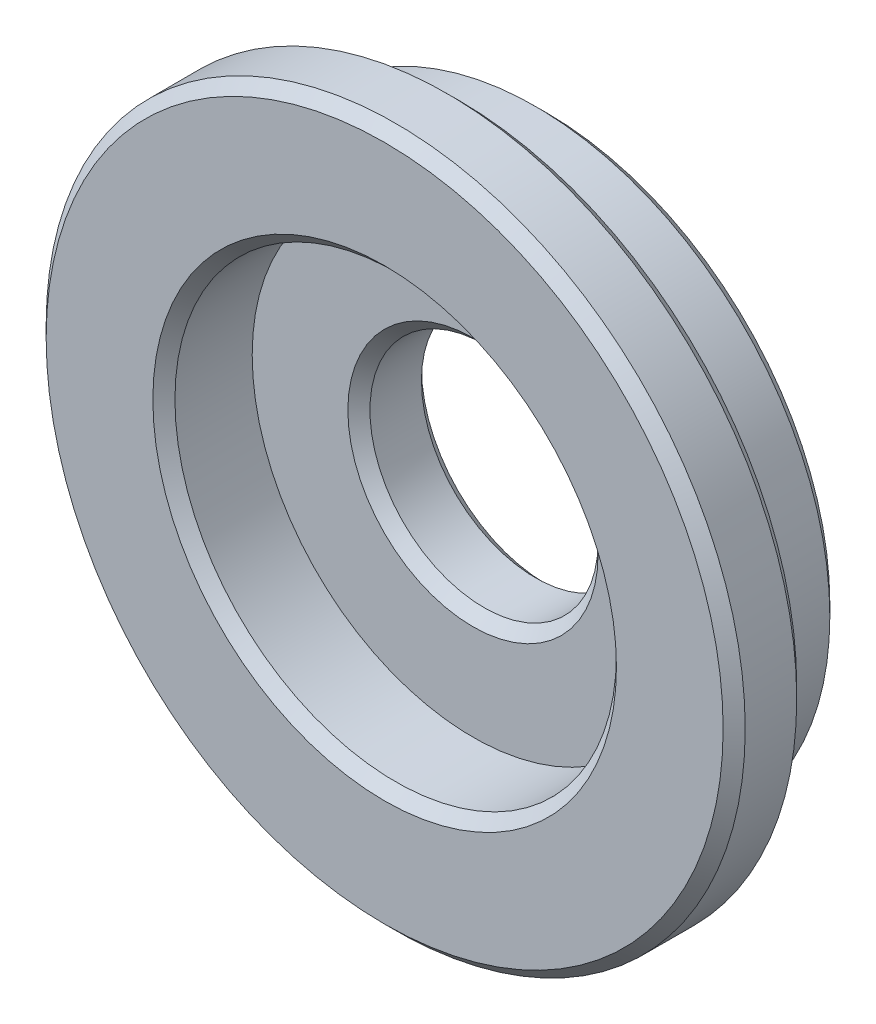
ISO-10303-21;
HEADER;
FILE_DESCRIPTION(('STEP AP214'),'2;1');
FILE_NAME('part.step','',(''),(''),'','','');
FILE_SCHEMA(('AUTOMOTIVE_DESIGN { 1 0 10303 214 1 1 1 1 }'));
ENDSEC;
DATA;
#1=APPLICATION_CONTEXT('core data for automotive mechanical design processes');
#2=APPLICATION_PROTOCOL_DEFINITION('international standard','automotive_design',2000,#1);
#3=PRODUCT_CONTEXT('',#1,'mechanical');
#4=PRODUCT('Part','Part','',(#3));
#5=PRODUCT_RELATED_PRODUCT_CATEGORY('part','',(#4));
#6=PRODUCT_DEFINITION_FORMATION('','',#4);
#7=PRODUCT_DEFINITION_CONTEXT('part definition',#1,'design');
#8=PRODUCT_DEFINITION('design','',#6,#7);
#9=PRODUCT_DEFINITION_SHAPE('','',#8);
#10=(LENGTH_UNIT() NAMED_UNIT(*) SI_UNIT(.MILLI.,.METRE.));
#11=(NAMED_UNIT(*) PLANE_ANGLE_UNIT() SI_UNIT($,.RADIAN.));
#12=(NAMED_UNIT(*) SI_UNIT($,.STERADIAN.) SOLID_ANGLE_UNIT());
#13=UNCERTAINTY_MEASURE_WITH_UNIT(LENGTH_MEASURE(1.E-05),#10,'distance_accuracy_value','');
#14=(GEOMETRIC_REPRESENTATION_CONTEXT(3) GLOBAL_UNCERTAINTY_ASSIGNED_CONTEXT((#13)) GLOBAL_UNIT_ASSIGNED_CONTEXT((#10,
#11,#12)) REPRESENTATION_CONTEXT('',''));
#15=CARTESIAN_POINT('',(0.,0.,0.));
#16=DIRECTION('',(0.,0.,1.));
#17=DIRECTION('',(1.,0.,0.));
#18=AXIS2_PLACEMENT_3D('',#15,#16,#17);
#19=CARTESIAN_POINT('',(0.,0.,1.));
#20=DIRECTION('',(0.,0.,1.));
#21=DIRECTION('',(1.,0.,0.));
#22=AXIS2_PLACEMENT_3D('',#19,#20,#21);
#23=PLANE('',#22);
#24=CARTESIAN_POINT('',(0.,0.,1.0000000000332));
#25=DIRECTION('',(0.,0.,1.));
#26=DIRECTION('',(1.,0.,0.));
#27=AXIS2_PLACEMENT_3D('',#24,#25,#26);
#28=CIRCLE('',#27,3.15000000006194);
#29=CARTESIAN_POINT('',(3.15000000006194,0.,1.0000000000332));
#30=VERTEX_POINT('',#29);
#31=EDGE_CURVE('E72',#30,#30,#28,.F.);
#32=ORIENTED_EDGE('',*,*,#31,.T.);
#33=EDGE_LOOP('',(#32));
#34=FACE_BOUND('',#33,.T.);
#35=CARTESIAN_POINT('',(0.,0.,1.0000000000332));
#36=DIRECTION('',(0.,0.,-1.));
#37=DIRECTION('',(-1.,0.,0.));
#38=AXIS2_PLACEMENT_3D('',#35,#36,#37);
#39=CIRCLE('',#38,4.59999999992533);
#40=CARTESIAN_POINT('',(-4.59999999992533,0.,1.0000000000332));
#41=VERTEX_POINT('',#40);
#42=EDGE_CURVE('E20',#41,#41,#39,.T.);
#43=ORIENTED_EDGE('',*,*,#42,.F.);
#44=EDGE_LOOP('',(#43));
#45=FACE_BOUND('',#44,.T.);
#46=ADVANCED_FACE('F17',(#34,#45),#23,.T.);
#47=CARTESIAN_POINT('',(0.,0.,0.85000000007085));
#48=DIRECTION('',(0.,0.,-1.));
#49=DIRECTION('',(-1.,0.,0.));
#50=AXIS2_PLACEMENT_3D('',#47,#48,#49);
#51=CONICAL_SURFACE('',#50,4.74999999988768,0.785398163397448);
#52=ORIENTED_EDGE('',*,*,#42,.T.);
#53=EDGE_LOOP('',(#52));
#54=FACE_BOUND('',#53,.T.);
#55=CARTESIAN_POINT('',(0.,0.,0.85));
#56=DIRECTION('',(0.,0.,1.));
#57=DIRECTION('',(1.,0.,0.));
#58=AXIS2_PLACEMENT_3D('',#55,#56,#57);
#59=CIRCLE('',#58,4.75);
#60=CARTESIAN_POINT('',(4.75,0.,0.85));
#61=VERTEX_POINT('',#60);
#62=EDGE_CURVE('E36',#61,#61,#59,.F.);
#63=ORIENTED_EDGE('',*,*,#62,.F.);
#64=EDGE_LOOP('',(#63));
#65=FACE_BOUND('',#64,.T.);
#66=ADVANCED_FACE('F239',(#54,#65),#51,.T.);
#67=CARTESIAN_POINT('',(0.,0.,0.99999999991951));
#68=DIRECTION('',(0.,0.,1.));
#69=DIRECTION('',(1.,0.,0.));
#70=AXIS2_PLACEMENT_3D('',#67,#68,#69);
#71=CONICAL_SURFACE('',#70,3.14999999994825,0.785398163397448);
#72=CARTESIAN_POINT('',(0.,0.,0.85));
#73=DIRECTION('',(0.,0.,1.));
#74=DIRECTION('',(1.,0.,0.));
#75=AXIS2_PLACEMENT_3D('',#72,#73,#74);
#76=CIRCLE('',#75,3.);
#77=CARTESIAN_POINT('',(3.,0.,0.85));
#78=VERTEX_POINT('',#77);
#79=EDGE_CURVE('E65',#78,#78,#76,.F.);
#80=ORIENTED_EDGE('',*,*,#79,.T.);
#81=EDGE_LOOP('',(#80));
#82=FACE_BOUND('',#81,.T.);
#83=ORIENTED_EDGE('',*,*,#31,.F.);
#84=EDGE_LOOP('',(#83));
#85=FACE_BOUND('',#84,.T.);
#86=ADVANCED_FACE('F230',(#82,#85),#71,.F.);
#87=CARTESIAN_POINT('',(0.,0.,-1.31));
#88=DIRECTION('',(0.,0.,1.));
#89=DIRECTION('',(1.,0.,0.));
#90=AXIS2_PLACEMENT_3D('',#87,#88,#89);
#91=CYLINDRICAL_SURFACE('',#90,4.75);
#92=ORIENTED_EDGE('',*,*,#62,.T.);
#93=EDGE_LOOP('',(#92));
#94=FACE_BOUND('',#93,.T.);
#95=CARTESIAN_POINT('',(0.,0.,0.15000000001919));
#96=DIRECTION('',(0.,0.,1.));
#97=DIRECTION('',(0.,-1.,0.));
#98=AXIS2_PLACEMENT_3D('',#95,#96,#97);
#99=CIRCLE('',#98,4.75000000000136);
#100=CARTESIAN_POINT('',(0.,-4.75000000000136,0.15000000001919));
#101=VERTEX_POINT('',#100);
#102=EDGE_CURVE('E61',#101,#101,#99,.F.);
#103=ORIENTED_EDGE('',*,*,#102,.F.);
#104=EDGE_LOOP('',(#103));
#105=FACE_BOUND('',#104,.T.);
#106=ADVANCED_FACE('F119',(#94,#105),#91,.T.);
#107=CARTESIAN_POINT('',(0.,0.,-1.31));
#108=DIRECTION('',(0.,0.,1.));
#109=DIRECTION('',(1.,0.,0.));
#110=AXIS2_PLACEMENT_3D('',#107,#108,#109);
#111=CYLINDRICAL_SURFACE('',#110,3.);
#112=CARTESIAN_POINT('',(0.,0.,-0.2));
#113=DIRECTION('',(0.,0.,1.));
#114=DIRECTION('',(1.,0.,0.));
#115=AXIS2_PLACEMENT_3D('',#112,#113,#114);
#116=CIRCLE('',#115,3.);
#117=CARTESIAN_POINT('',(3.,0.,-0.2));
#118=VERTEX_POINT('',#117);
#119=EDGE_CURVE('E64',#118,#118,#116,.T.);
#120=ORIENTED_EDGE('',*,*,#119,.F.);
#121=EDGE_LOOP('',(#120));
#122=FACE_BOUND('',#121,.T.);
#123=ORIENTED_EDGE('',*,*,#79,.F.);
#124=EDGE_LOOP('',(#123));
#125=FACE_BOUND('',#124,.T.);
#126=ADVANCED_FACE('F110',(#122,#125),#111,.F.);
#127=CARTESIAN_POINT('',(0.,0.,0.149999999905504));
#128=DIRECTION('',(0.,0.,1.));
#129=DIRECTION('',(1.,0.,0.));
#130=AXIS2_PLACEMENT_3D('',#127,#128,#129);
#131=CONICAL_SURFACE('',#130,4.74999999988768,0.785398163397448);
#132=ORIENTED_EDGE('',*,*,#102,.T.);
#133=EDGE_LOOP('',(#132));
#134=FACE_BOUND('',#133,.T.);
#135=CARTESIAN_POINT('',(0.,0.,0.));
#136=DIRECTION('',(0.,0.,1.));
#137=DIRECTION('',(1.,0.,0.));
#138=AXIS2_PLACEMENT_3D('',#135,#136,#137);
#139=CIRCLE('',#138,4.59999999998217);
#140=CARTESIAN_POINT('',(4.59999999998217,0.,0.));
#141=VERTEX_POINT('',#140);
#142=EDGE_CURVE('E84',#141,#141,#139,.T.);
#143=ORIENTED_EDGE('',*,*,#142,.T.);
#144=EDGE_LOOP('',(#143));
#145=FACE_BOUND('',#144,.T.);
#146=ADVANCED_FACE('F108',(#134,#145),#131,.T.);
#147=CARTESIAN_POINT('',(0.,0.,-0.2));
#148=DIRECTION('',(0.,0.,1.));
#149=DIRECTION('',(1.,0.,0.));
#150=AXIS2_PLACEMENT_3D('',#147,#148,#149);
#151=PLANE('',#150);
#152=CARTESIAN_POINT('',(0.,0.,-0.199999999949796));
#153=DIRECTION('',(0.,0.,1.));
#154=DIRECTION('',(1.,0.,0.));
#155=AXIS2_PLACEMENT_3D('',#152,#153,#154);
#156=CIRCLE('',#155,1.70000000002801);
#157=CARTESIAN_POINT('',(1.70000000002801,0.,-0.199999999949796));
#158=VERTEX_POINT('',#157);
#159=EDGE_CURVE('E88',#158,#158,#156,.F.);
#160=ORIENTED_EDGE('',*,*,#159,.T.);
#161=EDGE_LOOP('',(#160));
#162=FACE_BOUND('',#161,.T.);
#163=ORIENTED_EDGE('',*,*,#119,.T.);
#164=EDGE_LOOP('',(#163));
#165=FACE_BOUND('',#164,.T.);
#166=ADVANCED_FACE('F104',(#162,#165),#151,.T.);
#167=CARTESIAN_POINT('',(0.,0.,0.));
#168=DIRECTION('',(0.,0.,1.));
#169=DIRECTION('',(1.,0.,0.));
#170=AXIS2_PLACEMENT_3D('',#167,#168,#169);
#171=PLANE('',#170);
#172=CARTESIAN_POINT('',(0.,0.,0.));
#173=DIRECTION('',(0.,0.,1.));
#174=DIRECTION('',(1.,0.,0.));
#175=AXIS2_PLACEMENT_3D('',#172,#173,#174);
#176=CIRCLE('',#175,4.);
#177=CARTESIAN_POINT('',(4.,0.,0.));
#178=VERTEX_POINT('',#177);
#179=EDGE_CURVE('E40',#178,#178,#176,.F.);
#180=ORIENTED_EDGE('',*,*,#179,.F.);
#181=EDGE_LOOP('',(#180));
#182=FACE_BOUND('',#181,.T.);
#183=ORIENTED_EDGE('',*,*,#142,.F.);
#184=EDGE_LOOP('',(#183));
#185=FACE_BOUND('',#184,.T.);
#186=ADVANCED_FACE('F100',(#182,#185),#171,.F.);
#187=CARTESIAN_POINT('',(0.,0.,-0.200000000063483));
#188=DIRECTION('',(0.,0.,1.));
#189=DIRECTION('',(1.,0.,0.));
#190=AXIS2_PLACEMENT_3D('',#187,#188,#189);
#191=CONICAL_SURFACE('',#190,1.69999999991433,0.785398163397448);
#192=CARTESIAN_POINT('',(0.,0.,-0.35));
#193=DIRECTION('',(0.,0.,1.));
#194=DIRECTION('',(1.,0.,0.));
#195=AXIS2_PLACEMENT_3D('',#192,#193,#194);
#196=CIRCLE('',#195,1.55);
#197=CARTESIAN_POINT('',(1.55,0.,-0.35));
#198=VERTEX_POINT('',#197);
#199=EDGE_CURVE('E57',#198,#198,#196,.F.);
#200=ORIENTED_EDGE('',*,*,#199,.T.);
#201=EDGE_LOOP('',(#200));
#202=FACE_BOUND('',#201,.T.);
#203=ORIENTED_EDGE('',*,*,#159,.F.);
#204=EDGE_LOOP('',(#203));
#205=FACE_BOUND('',#204,.T.);
#206=ADVANCED_FACE('F103',(#202,#205),#191,.F.);
#207=CARTESIAN_POINT('',(0.,0.,-1.31));
#208=DIRECTION('',(0.,0.,1.));
#209=DIRECTION('',(1.,0.,0.));
#210=AXIS2_PLACEMENT_3D('',#207,#208,#209);
#211=CYLINDRICAL_SURFACE('',#210,4.);
#212=ORIENTED_EDGE('',*,*,#179,.T.);
#213=EDGE_LOOP('',(#212));
#214=FACE_BOUND('',#213,.T.);
#215=CARTESIAN_POINT('',(0.,0.,-1.05000000002065));
#216=DIRECTION('',(0.,0.,1.));
#217=DIRECTION('',(0.,-1.,0.));
#218=AXIS2_PLACEMENT_3D('',#215,#216,#217);
#219=CIRCLE('',#218,3.99999999996226);
#220=CARTESIAN_POINT('',(0.,-3.99999999996226,-1.05000000002065));
#221=VERTEX_POINT('',#220);
#222=EDGE_CURVE('E53',#221,#221,#219,.F.);
#223=ORIENTED_EDGE('',*,*,#222,.F.);
#224=EDGE_LOOP('',(#223));
#225=FACE_BOUND('',#224,.T.);
#226=ADVANCED_FACE('F97',(#214,#225),#211,.T.);
#227=CARTESIAN_POINT('',(0.,0.,-1.31));
#228=DIRECTION('',(0.,0.,1.));
#229=DIRECTION('',(1.,0.,0.));
#230=AXIS2_PLACEMENT_3D('',#227,#228,#229);
#231=CYLINDRICAL_SURFACE('',#230,1.55);
#232=ORIENTED_EDGE('',*,*,#199,.F.);
#233=EDGE_LOOP('',(#232));
#234=FACE_BOUND('',#233,.T.);
#235=CARTESIAN_POINT('',(0.,0.,-1.05000000002065));
#236=DIRECTION('',(0.,0.,-1.));
#237=DIRECTION('',(0.,1.,0.));
#238=AXIS2_PLACEMENT_3D('',#235,#236,#237);
#239=CIRCLE('',#238,1.55000000000882);
#240=CARTESIAN_POINT('',(0.,1.55000000000882,-1.05000000002065));
#241=VERTEX_POINT('',#240);
#242=EDGE_CURVE('E32',#241,#241,#239,.T.);
#243=ORIENTED_EDGE('',*,*,#242,.T.);
#244=EDGE_LOOP('',(#243));
#245=FACE_BOUND('',#244,.T.);
#246=ADVANCED_FACE('F136',(#234,#245),#231,.F.);
#247=CARTESIAN_POINT('',(0.,0.,-1.05000000013433));
#248=DIRECTION('',(0.,0.,1.));
#249=DIRECTION('',(1.,0.,0.));
#250=AXIS2_PLACEMENT_3D('',#247,#248,#249);
#251=CONICAL_SURFACE('',#250,3.99999999984857,0.785398163397448);
#252=ORIENTED_EDGE('',*,*,#222,.T.);
#253=EDGE_LOOP('',(#252));
#254=FACE_BOUND('',#253,.T.);
#255=CARTESIAN_POINT('',(0.,0.,-1.19999999998299));
#256=DIRECTION('',(0.,0.,1.));
#257=DIRECTION('',(1.,0.,0.));
#258=AXIS2_PLACEMENT_3D('',#255,#256,#257);
#259=CIRCLE('',#258,3.84999999999991);
#260=CARTESIAN_POINT('',(3.84999999999991,0.,-1.19999999998299));
#261=VERTEX_POINT('',#260);
#262=EDGE_CURVE('E26',#261,#261,#259,.T.);
#263=ORIENTED_EDGE('',*,*,#262,.T.);
#264=EDGE_LOOP('',(#263));
#265=FACE_BOUND('',#264,.T.);
#266=ADVANCED_FACE('F130',(#254,#265),#251,.T.);
#267=CARTESIAN_POINT('',(0.,0.,-1.19999999992615));
#268=DIRECTION('',(0.,0.,-1.));
#269=DIRECTION('',(-1.,0.,0.));
#270=AXIS2_PLACEMENT_3D('',#267,#268,#269);
#271=CONICAL_SURFACE('',#270,1.69999999991433,0.785398163397448);
#272=CARTESIAN_POINT('',(0.,0.,-1.20000000003984));
#273=DIRECTION('',(0.,0.,-1.));
#274=DIRECTION('',(-1.,0.,0.));
#275=AXIS2_PLACEMENT_3D('',#272,#273,#274);
#276=CIRCLE('',#275,1.70000000002801);
#277=CARTESIAN_POINT('',(-1.70000000002801,0.,-1.20000000003984));
#278=VERTEX_POINT('',#277);
#279=EDGE_CURVE('E10',#278,#278,#276,.T.);
#280=ORIENTED_EDGE('',*,*,#279,.T.);
#281=EDGE_LOOP('',(#280));
#282=FACE_BOUND('',#281,.T.);
#283=ORIENTED_EDGE('',*,*,#242,.F.);
#284=EDGE_LOOP('',(#283));
#285=FACE_BOUND('',#284,.T.);
#286=ADVANCED_FACE('F124',(#282,#285),#271,.F.);
#287=CARTESIAN_POINT('',(0.,0.,-1.2));
#288=DIRECTION('',(0.,0.,1.));
#289=DIRECTION('',(1.,0.,0.));
#290=AXIS2_PLACEMENT_3D('',#287,#288,#289);
#291=PLANE('',#290);
#292=ORIENTED_EDGE('',*,*,#279,.F.);
#293=EDGE_LOOP('',(#292));
#294=FACE_BOUND('',#293,.T.);
#295=ORIENTED_EDGE('',*,*,#262,.F.);
#296=EDGE_LOOP('',(#295));
#297=FACE_BOUND('',#296,.T.);
#298=ADVANCED_FACE('F122',(#294,#297),#291,.F.);
#299=CLOSED_SHELL('',(#46,#66,#86,#106,#126,#146,#166,#186,#206,#226,#246,#266,#286,#298));
#300=MANIFOLD_SOLID_BREP('B1',#299);
#301=ADVANCED_BREP_SHAPE_REPRESENTATION('',(#18,#300),#14);
#302=SHAPE_DEFINITION_REPRESENTATION(#9,#301);
ENDSEC;
END-ISO-10303-21;
